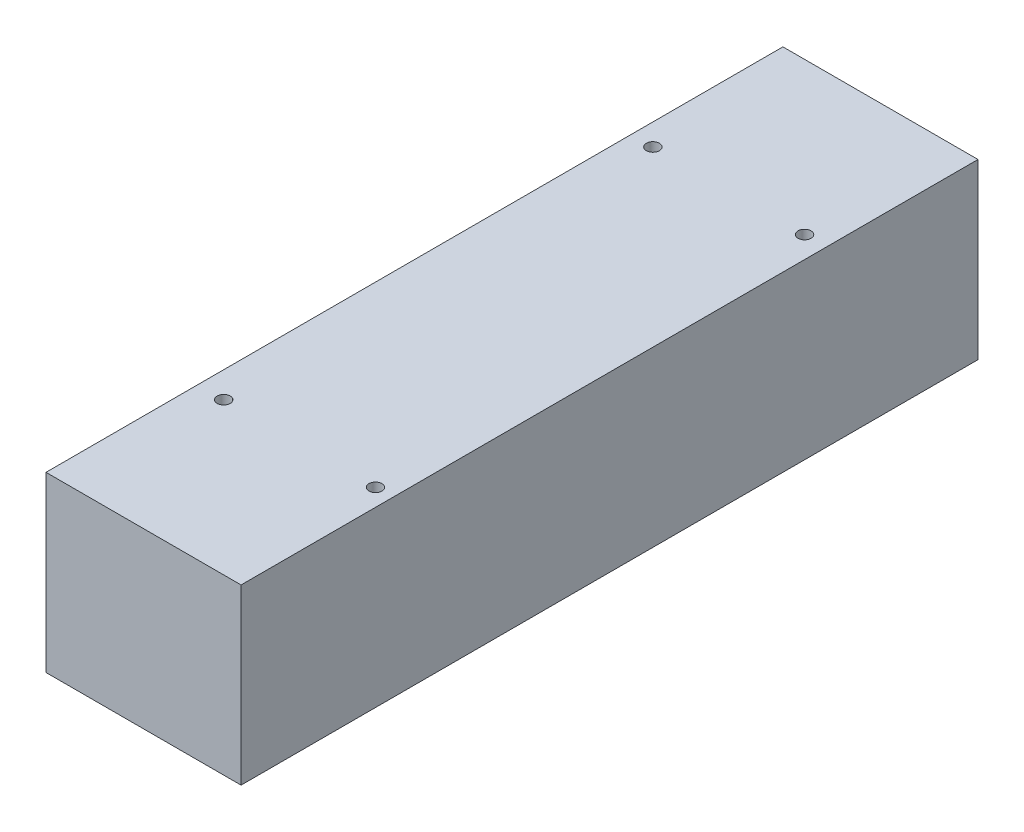
ISO-10303-21;
HEADER;
FILE_DESCRIPTION(('STEP AP214'),'2;1');
FILE_NAME('part.step','',(''),(''),'','','');
FILE_SCHEMA(('AUTOMOTIVE_DESIGN { 1 0 10303 214 1 1 1 1 }'));
ENDSEC;
DATA;
#1=APPLICATION_CONTEXT('core data for automotive mechanical design processes');
#2=APPLICATION_PROTOCOL_DEFINITION('international standard','automotive_design',2000,#1);
#3=PRODUCT_CONTEXT('',#1,'mechanical');
#4=PRODUCT('Part','Part','',(#3));
#5=PRODUCT_RELATED_PRODUCT_CATEGORY('part','',(#4));
#6=PRODUCT_DEFINITION_FORMATION('','',#4);
#7=PRODUCT_DEFINITION_CONTEXT('part definition',#1,'design');
#8=PRODUCT_DEFINITION('design','',#6,#7);
#9=PRODUCT_DEFINITION_SHAPE('','',#8);
#10=(LENGTH_UNIT() NAMED_UNIT(*) SI_UNIT(.MILLI.,.METRE.));
#11=(NAMED_UNIT(*) PLANE_ANGLE_UNIT() SI_UNIT($,.RADIAN.));
#12=(NAMED_UNIT(*) SI_UNIT($,.STERADIAN.) SOLID_ANGLE_UNIT());
#13=UNCERTAINTY_MEASURE_WITH_UNIT(LENGTH_MEASURE(1.E-05),#10,'distance_accuracy_value','');
#14=(GEOMETRIC_REPRESENTATION_CONTEXT(3) GLOBAL_UNCERTAINTY_ASSIGNED_CONTEXT((#13)) GLOBAL_UNIT_ASSIGNED_CONTEXT((#10,
#11,#12)) REPRESENTATION_CONTEXT('',''));
#15=CARTESIAN_POINT('',(0.,0.,0.));
#16=DIRECTION('',(0.,0.,1.));
#17=DIRECTION('',(1.,0.,0.));
#18=AXIS2_PLACEMENT_3D('',#15,#16,#17);
#19=CARTESIAN_POINT('',(-36.1155647631057,22.4038461538461,170.));
#20=DIRECTION('',(1.,0.,0.));
#21=DIRECTION('',(0.,0.,-1.));
#22=AXIS2_PLACEMENT_3D('',#19,#20,#21);
#23=PLANE('',#22);
#24=DIRECTION('',(0.,-1.,0.));
#25=VECTOR('',#24,1.);
#26=CARTESIAN_POINT('',(-36.1155647631057,22.4038461538461,0.));
#27=LINE('',#26,#25);
#28=CARTESIAN_POINT('',(-36.1155647631057,22.4038461538461,0.));
#29=VERTEX_POINT('',#28);
#30=CARTESIAN_POINT('',(-36.1155647631057,-17.5961538461539,0.));
#31=VERTEX_POINT('',#30);
#32=EDGE_CURVE('E96',#29,#31,#27,.T.);
#33=ORIENTED_EDGE('',*,*,#32,.T.);
#34=DIRECTION('',(0.,0.,-1.));
#35=VECTOR('',#34,1.);
#36=CARTESIAN_POINT('',(-36.1155647631057,-17.5961538461539,170.));
#37=LINE('',#36,#35);
#38=CARTESIAN_POINT('',(-36.1155647631057,-17.5961538461539,170.));
#39=VERTEX_POINT('',#38);
#40=EDGE_CURVE('E11',#39,#31,#37,.T.);
#41=ORIENTED_EDGE('',*,*,#40,.F.);
#42=DIRECTION('',(0.,-1.,0.));
#43=VECTOR('',#42,1.);
#44=CARTESIAN_POINT('',(-36.1155647631057,22.4038461538461,170.));
#45=LINE('',#44,#43);
#46=CARTESIAN_POINT('',(-36.1155647631057,22.4038461538461,170.));
#47=VERTEX_POINT('',#46);
#48=EDGE_CURVE('E84',#47,#39,#45,.T.);
#49=ORIENTED_EDGE('',*,*,#48,.F.);
#50=DIRECTION('',(0.,0.,-1.));
#51=VECTOR('',#50,1.);
#52=CARTESIAN_POINT('',(-36.1155647631057,22.4038461538461,170.));
#53=LINE('',#52,#51);
#54=EDGE_CURVE('E92',#47,#29,#53,.T.);
#55=ORIENTED_EDGE('',*,*,#54,.T.);
#56=EDGE_LOOP('',(#33,#41,#49,#55));
#57=FACE_BOUND('',#56,.T.);
#58=ADVANCED_FACE('F33',(#57),#23,.F.);
#59=CARTESIAN_POINT('',(-36.1155647631057,-17.5961538461539,170.));
#60=DIRECTION('',(0.,1.,0.));
#61=DIRECTION('',(0.,0.,1.));
#62=AXIS2_PLACEMENT_3D('',#59,#60,#61);
#63=PLANE('',#62);
#64=DIRECTION('',(1.,0.,0.));
#65=VECTOR('',#64,1.);
#66=CARTESIAN_POINT('',(-36.1155647631057,-17.5961538461539,0.));
#67=LINE('',#66,#65);
#68=CARTESIAN_POINT('',(8.88443523689427,-17.5961538461539,0.));
#69=VERTEX_POINT('',#68);
#70=EDGE_CURVE('E88',#31,#69,#67,.T.);
#71=ORIENTED_EDGE('',*,*,#70,.T.);
#72=DIRECTION('',(0.,0.,-1.));
#73=VECTOR('',#72,1.);
#74=CARTESIAN_POINT('',(8.88443523689427,-17.5961538461539,170.));
#75=LINE('',#74,#73);
#76=CARTESIAN_POINT('',(8.88443523689427,-17.5961538461539,170.));
#77=VERTEX_POINT('',#76);
#78=EDGE_CURVE('E41',#77,#69,#75,.T.);
#79=ORIENTED_EDGE('',*,*,#78,.F.);
#80=DIRECTION('',(1.,0.,0.));
#81=VECTOR('',#80,1.);
#82=CARTESIAN_POINT('',(-36.1155647631057,-17.5961538461539,170.));
#83=LINE('',#82,#81);
#84=EDGE_CURVE('E79',#39,#77,#83,.T.);
#85=ORIENTED_EDGE('',*,*,#84,.F.);
#86=ORIENTED_EDGE('',*,*,#40,.T.);
#87=EDGE_LOOP('',(#71,#79,#85,#86));
#88=FACE_BOUND('',#87,.T.);
#89=ADVANCED_FACE('F87',(#88),#63,.F.);
#90=CARTESIAN_POINT('',(8.88443523689426,22.4038461538461,170.));
#91=DIRECTION('',(-1.,0.,0.));
#92=DIRECTION('',(0.,-1.,0.));
#93=AXIS2_PLACEMENT_3D('',#90,#91,#92);
#94=PLANE('',#93);
#95=DIRECTION('',(0.,1.,0.));
#96=VECTOR('',#95,1.);
#97=CARTESIAN_POINT('',(8.88443523689426,22.4038461538461,0.));
#98=LINE('',#97,#96);
#99=CARTESIAN_POINT('',(8.88443523689426,22.4038461538461,0.));
#100=VERTEX_POINT('',#99);
#101=EDGE_CURVE('E66',#69,#100,#98,.T.);
#102=ORIENTED_EDGE('',*,*,#101,.T.);
#103=DIRECTION('',(0.,0.,-1.));
#104=VECTOR('',#103,1.);
#105=CARTESIAN_POINT('',(8.88443523689426,22.4038461538461,170.));
#106=LINE('',#105,#104);
#107=CARTESIAN_POINT('',(8.88443523689426,22.4038461538461,170.));
#108=VERTEX_POINT('',#107);
#109=EDGE_CURVE('E89',#108,#100,#106,.T.);
#110=ORIENTED_EDGE('',*,*,#109,.F.);
#111=DIRECTION('',(0.,1.,0.));
#112=VECTOR('',#111,1.);
#113=CARTESIAN_POINT('',(8.88443523689426,22.4038461538461,170.));
#114=LINE('',#113,#112);
#115=EDGE_CURVE('E82',#77,#108,#114,.T.);
#116=ORIENTED_EDGE('',*,*,#115,.F.);
#117=ORIENTED_EDGE('',*,*,#78,.T.);
#118=EDGE_LOOP('',(#102,#110,#116,#117));
#119=FACE_BOUND('',#118,.T.);
#120=ADVANCED_FACE('F90',(#119),#94,.F.);
#121=CARTESIAN_POINT('',(-36.1155647631057,22.4038461538461,170.));
#122=DIRECTION('',(0.,-1.,0.));
#123=DIRECTION('',(0.,0.,-1.));
#124=AXIS2_PLACEMENT_3D('',#121,#122,#123);
#125=PLANE('',#124);
#126=CARTESIAN_POINT('',(4.88443523689426,22.4038461538461,135.));
#127=DIRECTION('',(0.,1.,0.));
#128=DIRECTION('',(0.,0.,1.));
#129=AXIS2_PLACEMENT_3D('',#126,#127,#128);
#130=CIRCLE('',#129,1.5);
#131=CARTESIAN_POINT('',(4.88443523689426,22.4038461538461,136.5));
#132=VERTEX_POINT('',#131);
#133=EDGE_CURVE('E128',#132,#132,#130,.T.);
#134=ORIENTED_EDGE('',*,*,#133,.F.);
#135=EDGE_LOOP('',(#134));
#136=FACE_BOUND('',#135,.T.);
#137=CARTESIAN_POINT('',(-30.1155647631057,22.4038461538461,135.));
#138=DIRECTION('',(0.,1.,0.));
#139=DIRECTION('',(0.,0.,1.));
#140=AXIS2_PLACEMENT_3D('',#137,#138,#139);
#141=CIRCLE('',#140,1.5);
#142=CARTESIAN_POINT('',(-30.1155647631057,22.4038461538461,136.5));
#143=VERTEX_POINT('',#142);
#144=EDGE_CURVE('E122',#143,#143,#141,.T.);
#145=ORIENTED_EDGE('',*,*,#144,.F.);
#146=EDGE_LOOP('',(#145));
#147=FACE_BOUND('',#146,.T.);
#148=CARTESIAN_POINT('',(3.88443523689427,22.4038461538461,35.0050001250063));
#149=DIRECTION('',(0.,1.,0.));
#150=DIRECTION('',(0.,0.,1.));
#151=AXIS2_PLACEMENT_3D('',#148,#149,#150);
#152=CIRCLE('',#151,1.5);
#153=CARTESIAN_POINT('',(3.88443523689427,22.4038461538461,36.5050001250063));
#154=VERTEX_POINT('',#153);
#155=EDGE_CURVE('E116',#154,#154,#152,.T.);
#156=ORIENTED_EDGE('',*,*,#155,.F.);
#157=EDGE_LOOP('',(#156));
#158=FACE_BOUND('',#157,.T.);
#159=CARTESIAN_POINT('',(-31.1155647631057,22.4038461538461,35.0050001250062));
#160=DIRECTION('',(0.,1.,0.));
#161=DIRECTION('',(0.,0.,1.));
#162=AXIS2_PLACEMENT_3D('',#159,#160,#161);
#163=CIRCLE('',#162,1.5);
#164=CARTESIAN_POINT('',(-31.1155647631057,22.4038461538461,36.5050001250062));
#165=VERTEX_POINT('',#164);
#166=EDGE_CURVE('E110',#165,#165,#163,.T.);
#167=ORIENTED_EDGE('',*,*,#166,.F.);
#168=EDGE_LOOP('',(#167));
#169=FACE_BOUND('',#168,.T.);
#170=DIRECTION('',(-1.,0.,0.));
#171=VECTOR('',#170,1.);
#172=CARTESIAN_POINT('',(-36.1155647631057,22.4038461538461,0.));
#173=LINE('',#172,#171);
#174=EDGE_CURVE('E72',#100,#29,#173,.T.);
#175=ORIENTED_EDGE('',*,*,#174,.T.);
#176=ORIENTED_EDGE('',*,*,#54,.F.);
#177=DIRECTION('',(-1.,0.,0.));
#178=VECTOR('',#177,1.);
#179=CARTESIAN_POINT('',(-36.1155647631057,22.4038461538461,170.));
#180=LINE('',#179,#178);
#181=EDGE_CURVE('E49',#108,#47,#180,.T.);
#182=ORIENTED_EDGE('',*,*,#181,.F.);
#183=ORIENTED_EDGE('',*,*,#109,.T.);
#184=EDGE_LOOP('',(#175,#176,#182,#183));
#185=FACE_BOUND('',#184,.T.);
#186=ADVANCED_FACE('F104',(#136,#147,#158,#169,#185),#125,.F.);
#187=CARTESIAN_POINT('',(0.,0.,170.));
#188=DIRECTION('',(0.,0.,1.));
#189=DIRECTION('',(1.,0.,0.));
#190=AXIS2_PLACEMENT_3D('',#187,#188,#189);
#191=PLANE('',#190);
#192=ORIENTED_EDGE('',*,*,#48,.T.);
#193=ORIENTED_EDGE('',*,*,#84,.T.);
#194=ORIENTED_EDGE('',*,*,#115,.T.);
#195=ORIENTED_EDGE('',*,*,#181,.T.);
#196=EDGE_LOOP('',(#192,#193,#194,#195));
#197=FACE_BOUND('',#196,.T.);
#198=ADVANCED_FACE('F80',(#197),#191,.T.);
#199=CARTESIAN_POINT('',(0.,0.,0.));
#200=DIRECTION('',(0.,0.,1.));
#201=DIRECTION('',(1.,0.,0.));
#202=AXIS2_PLACEMENT_3D('',#199,#200,#201);
#203=PLANE('',#202);
#204=ORIENTED_EDGE('',*,*,#32,.F.);
#205=ORIENTED_EDGE('',*,*,#174,.F.);
#206=ORIENTED_EDGE('',*,*,#101,.F.);
#207=ORIENTED_EDGE('',*,*,#70,.F.);
#208=EDGE_LOOP('',(#204,#205,#206,#207));
#209=FACE_BOUND('',#208,.T.);
#210=ADVANCED_FACE('F107',(#209),#203,.F.);
#211=CARTESIAN_POINT('',(-31.1155647631057,16.4038461538461,35.0050001250062));
#212=DIRECTION('',(0.,1.,0.));
#213=DIRECTION('',(0.,0.,1.));
#214=AXIS2_PLACEMENT_3D('',#211,#212,#213);
#215=CYLINDRICAL_SURFACE('',#214,1.5);
#216=CARTESIAN_POINT('',(-31.1155647631057,16.4038461538461,35.0050001250062));
#217=DIRECTION('',(0.,1.,0.));
#218=DIRECTION('',(0.,0.,1.));
#219=AXIS2_PLACEMENT_3D('',#216,#217,#218);
#220=CIRCLE('',#219,1.5);
#221=CARTESIAN_POINT('',(-31.1155647631057,16.4038461538461,36.5050001250062));
#222=VERTEX_POINT('',#221);
#223=EDGE_CURVE('E99',#222,#222,#220,.T.);
#224=ORIENTED_EDGE('',*,*,#223,.F.);
#225=EDGE_LOOP('',(#224));
#226=FACE_BOUND('',#225,.T.);
#227=ORIENTED_EDGE('',*,*,#166,.T.);
#228=EDGE_LOOP('',(#227));
#229=FACE_BOUND('',#228,.T.);
#230=ADVANCED_FACE('F152',(#226,#229),#215,.F.);
#231=CARTESIAN_POINT('',(-31.1155647631057,16.4038461538461,35.0050001250062));
#232=DIRECTION('',(0.,1.,0.));
#233=DIRECTION('',(0.,0.,1.));
#234=AXIS2_PLACEMENT_3D('',#231,#232,#233);
#235=PLANE('',#234);
#236=ORIENTED_EDGE('',*,*,#223,.T.);
#237=EDGE_LOOP('',(#236));
#238=FACE_BOUND('',#237,.T.);
#239=ADVANCED_FACE('F154',(#238),#235,.T.);
#240=CARTESIAN_POINT('',(3.88443523689427,16.4038461538461,35.0050001250063));
#241=DIRECTION('',(0.,1.,0.));
#242=DIRECTION('',(0.,0.,1.));
#243=AXIS2_PLACEMENT_3D('',#240,#241,#242);
#244=CYLINDRICAL_SURFACE('',#243,1.5);
#245=CARTESIAN_POINT('',(3.88443523689427,16.4038461538461,35.0050001250063));
#246=DIRECTION('',(0.,1.,0.));
#247=DIRECTION('',(0.,0.,1.));
#248=AXIS2_PLACEMENT_3D('',#245,#246,#247);
#249=CIRCLE('',#248,1.5);
#250=CARTESIAN_POINT('',(3.88443523689427,16.4038461538461,36.5050001250063));
#251=VERTEX_POINT('',#250);
#252=EDGE_CURVE('E113',#251,#251,#249,.T.);
#253=ORIENTED_EDGE('',*,*,#252,.F.);
#254=EDGE_LOOP('',(#253));
#255=FACE_BOUND('',#254,.T.);
#256=ORIENTED_EDGE('',*,*,#155,.T.);
#257=EDGE_LOOP('',(#256));
#258=FACE_BOUND('',#257,.T.);
#259=ADVANCED_FACE('F161',(#255,#258),#244,.F.);
#260=CARTESIAN_POINT('',(3.88443523689427,16.4038461538461,35.0050001250063));
#261=DIRECTION('',(0.,1.,0.));
#262=DIRECTION('',(0.,0.,1.));
#263=AXIS2_PLACEMENT_3D('',#260,#261,#262);
#264=PLANE('',#263);
#265=ORIENTED_EDGE('',*,*,#252,.T.);
#266=EDGE_LOOP('',(#265));
#267=FACE_BOUND('',#266,.T.);
#268=ADVANCED_FACE('F206',(#267),#264,.T.);
#269=CARTESIAN_POINT('',(-30.1155647631057,16.4038461538461,135.));
#270=DIRECTION('',(0.,1.,0.));
#271=DIRECTION('',(0.,0.,1.));
#272=AXIS2_PLACEMENT_3D('',#269,#270,#271);
#273=CYLINDRICAL_SURFACE('',#272,1.5);
#274=CARTESIAN_POINT('',(-30.1155647631057,16.4038461538461,135.));
#275=DIRECTION('',(0.,1.,0.));
#276=DIRECTION('',(0.,0.,1.));
#277=AXIS2_PLACEMENT_3D('',#274,#275,#276);
#278=CIRCLE('',#277,1.5);
#279=CARTESIAN_POINT('',(-30.1155647631057,16.4038461538461,136.5));
#280=VERTEX_POINT('',#279);
#281=EDGE_CURVE('E119',#280,#280,#278,.T.);
#282=ORIENTED_EDGE('',*,*,#281,.F.);
#283=EDGE_LOOP('',(#282));
#284=FACE_BOUND('',#283,.T.);
#285=ORIENTED_EDGE('',*,*,#144,.T.);
#286=EDGE_LOOP('',(#285));
#287=FACE_BOUND('',#286,.T.);
#288=ADVANCED_FACE('F216',(#284,#287),#273,.F.);
#289=CARTESIAN_POINT('',(-30.1155647631057,16.4038461538461,135.));
#290=DIRECTION('',(0.,1.,0.));
#291=DIRECTION('',(0.,0.,1.));
#292=AXIS2_PLACEMENT_3D('',#289,#290,#291);
#293=PLANE('',#292);
#294=ORIENTED_EDGE('',*,*,#281,.T.);
#295=EDGE_LOOP('',(#294));
#296=FACE_BOUND('',#295,.T.);
#297=ADVANCED_FACE('F139',(#296),#293,.T.);
#298=CARTESIAN_POINT('',(4.88443523689426,16.4038461538461,135.));
#299=DIRECTION('',(0.,1.,0.));
#300=DIRECTION('',(0.,0.,1.));
#301=AXIS2_PLACEMENT_3D('',#298,#299,#300);
#302=CYLINDRICAL_SURFACE('',#301,1.5);
#303=CARTESIAN_POINT('',(4.88443523689426,16.4038461538461,135.));
#304=DIRECTION('',(0.,1.,0.));
#305=DIRECTION('',(0.,0.,1.));
#306=AXIS2_PLACEMENT_3D('',#303,#304,#305);
#307=CIRCLE('',#306,1.5);
#308=CARTESIAN_POINT('',(4.88443523689426,16.4038461538461,136.5));
#309=VERTEX_POINT('',#308);
#310=EDGE_CURVE('E125',#309,#309,#307,.T.);
#311=ORIENTED_EDGE('',*,*,#310,.F.);
#312=EDGE_LOOP('',(#311));
#313=FACE_BOUND('',#312,.T.);
#314=ORIENTED_EDGE('',*,*,#133,.T.);
#315=EDGE_LOOP('',(#314));
#316=FACE_BOUND('',#315,.T.);
#317=ADVANCED_FACE('F136',(#313,#316),#302,.F.);
#318=CARTESIAN_POINT('',(4.88443523689426,16.4038461538461,135.));
#319=DIRECTION('',(0.,1.,0.));
#320=DIRECTION('',(0.,0.,1.));
#321=AXIS2_PLACEMENT_3D('',#318,#319,#320);
#322=PLANE('',#321);
#323=ORIENTED_EDGE('',*,*,#310,.T.);
#324=EDGE_LOOP('',(#323));
#325=FACE_BOUND('',#324,.T.);
#326=ADVANCED_FACE('F134',(#325),#322,.T.);
#327=CLOSED_SHELL('',(#58,#89,#120,#186,#198,#210,#230,#239,#259,#268,#288,#297,#317,#326));
#328=MANIFOLD_SOLID_BREP('B2',#327);
#329=ADVANCED_BREP_SHAPE_REPRESENTATION('',(#18,#328),#14);
#330=SHAPE_DEFINITION_REPRESENTATION(#9,#329);
ENDSEC;
END-ISO-10303-21;
